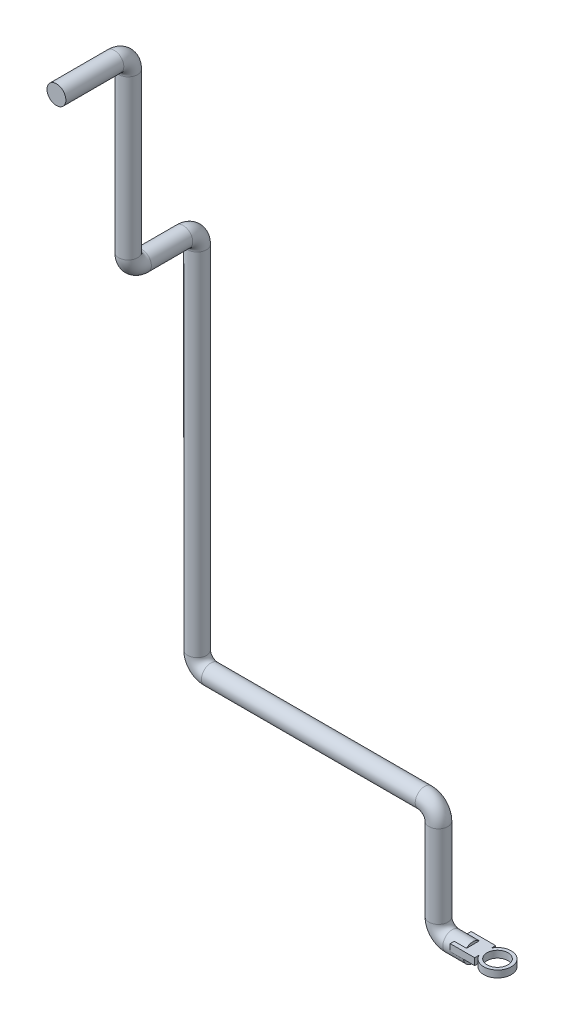
ISO-10303-21;
HEADER;
FILE_DESCRIPTION(('STEP AP214'),'2;1');
FILE_NAME('part.step','',(''),(''),'','','');
FILE_SCHEMA(('AUTOMOTIVE_DESIGN { 1 0 10303 214 1 1 1 1 }'));
ENDSEC;
DATA;
#1=APPLICATION_CONTEXT('core data for automotive mechanical design processes');
#2=APPLICATION_PROTOCOL_DEFINITION('international standard','automotive_design',2000,#1);
#3=PRODUCT_CONTEXT('',#1,'mechanical');
#4=PRODUCT('Part','Part','',(#3));
#5=PRODUCT_RELATED_PRODUCT_CATEGORY('part','',(#4));
#6=PRODUCT_DEFINITION_FORMATION('','',#4);
#7=PRODUCT_DEFINITION_CONTEXT('part definition',#1,'design');
#8=PRODUCT_DEFINITION('design','',#6,#7);
#9=PRODUCT_DEFINITION_SHAPE('','',#8);
#10=(LENGTH_UNIT() NAMED_UNIT(*) SI_UNIT(.MILLI.,.METRE.));
#11=(NAMED_UNIT(*) PLANE_ANGLE_UNIT() SI_UNIT($,.RADIAN.));
#12=(NAMED_UNIT(*) SI_UNIT($,.STERADIAN.) SOLID_ANGLE_UNIT());
#13=UNCERTAINTY_MEASURE_WITH_UNIT(LENGTH_MEASURE(1.E-05),#10,'distance_accuracy_value','');
#14=(GEOMETRIC_REPRESENTATION_CONTEXT(3) GLOBAL_UNCERTAINTY_ASSIGNED_CONTEXT((#13)) GLOBAL_UNIT_ASSIGNED_CONTEXT((#10,
#11,#12)) REPRESENTATION_CONTEXT('',''));
#15=CARTESIAN_POINT('',(0.,0.,0.));
#16=DIRECTION('',(0.,0.,1.));
#17=DIRECTION('',(1.,0.,0.));
#18=AXIS2_PLACEMENT_3D('',#15,#16,#17);
#19=CARTESIAN_POINT('',(0.,0.,0.));
#20=DIRECTION('',(1.,0.,0.));
#21=DIRECTION('',(0.,0.,-1.));
#22=AXIS2_PLACEMENT_3D('',#19,#20,#21);
#23=PLANE('',#22);
#24=CARTESIAN_POINT('',(0.,0.,0.));
#25=DIRECTION('',(1.,0.,0.));
#26=DIRECTION('',(0.,0.,-1.));
#27=AXIS2_PLACEMENT_3D('',#24,#25,#26);
#28=CIRCLE('',#27,13.7);
#29=CARTESIAN_POINT('',(0.,0.,13.7));
#30=VERTEX_POINT('',#29);
#31=CARTESIAN_POINT('',(0.,0.,-13.7));
#32=VERTEX_POINT('',#31);
#33=EDGE_CURVE('E185',#30,#32,#28,.T.);
#34=ORIENTED_EDGE('',*,*,#33,.T.);
#35=DIRECTION('',(0.,0.,1.));
#36=VECTOR('',#35,1.);
#37=CARTESIAN_POINT('',(0.,0.,0.));
#38=LINE('',#37,#36);
#39=EDGE_CURVE('E122',#32,#30,#38,.T.);
#40=ORIENTED_EDGE('',*,*,#39,.T.);
#41=EDGE_LOOP('',(#34,#40));
#42=FACE_BOUND('',#41,.T.);
#43=ADVANCED_FACE('F36',(#42),#23,.T.);
#44=DIRECTION('',(0.,0.,1.));
#45=VECTOR('',#44,1.);
#46=CARTESIAN_POINT('',(0.,10.,0.));
#47=LINE('',#46,#45);
#48=CARTESIAN_POINT('',(0.,10.,-9.36429388688757));
#49=VERTEX_POINT('',#48);
#50=CARTESIAN_POINT('',(0.,10.,9.36429388688757));
#51=VERTEX_POINT('',#50);
#52=EDGE_CURVE('E182',#49,#51,#47,.T.);
#53=ORIENTED_EDGE('',*,*,#52,.F.);
#54=EDGE_CURVE('E188',#49,#51,#28,.T.);
#55=ORIENTED_EDGE('',*,*,#54,.T.);
#56=EDGE_LOOP('',(#53,#55));
#57=FACE_BOUND('',#56,.T.);
#58=ADVANCED_FACE('F38',(#57),#23,.T.);
#59=CARTESIAN_POINT('',(-400.,979.4,204.));
#60=DIRECTION('',(0.,0.,-1.));
#61=DIRECTION('',(0.,1.,0.));
#62=AXIS2_PLACEMENT_3D('',#59,#60,#61);
#63=PLANE('',#62);
#64=CARTESIAN_POINT('',(-400.,979.4,204.));
#65=DIRECTION('',(0.,0.,-1.));
#66=DIRECTION('',(0.,1.,0.));
#67=AXIS2_PLACEMENT_3D('',#64,#65,#66);
#68=CIRCLE('',#67,13.7);
#69=CARTESIAN_POINT('',(-400.,993.1,204.));
#70=VERTEX_POINT('',#69);
#71=EDGE_CURVE('E225',#70,#70,#68,.T.);
#72=ORIENTED_EDGE('',*,*,#71,.F.);
#73=EDGE_LOOP('',(#72));
#74=FACE_BOUND('',#73,.T.);
#75=ADVANCED_FACE('F264',(#74),#63,.F.);
#76=CARTESIAN_POINT('',(0.,0.,0.));
#77=DIRECTION('',(-1.,0.,0.));
#78=DIRECTION('',(0.,0.,1.));
#79=AXIS2_PLACEMENT_3D('',#76,#77,#78);
#80=CYLINDRICAL_SURFACE('',#79,13.7);
#81=CARTESIAN_POINT('',(-30.,0.,0.));
#82=DIRECTION('',(1.,0.,0.));
#83=DIRECTION('',(0.,0.,-1.));
#84=AXIS2_PLACEMENT_3D('',#81,#82,#83);
#85=CIRCLE('',#84,13.7);
#86=CARTESIAN_POINT('',(-30.,-13.7,0.));
#87=VERTEX_POINT('',#86);
#88=EDGE_CURVE('E189',#87,#87,#85,.T.);
#89=ORIENTED_EDGE('',*,*,#88,.T.);
#90=EDGE_LOOP('',(#89));
#91=FACE_BOUND('',#90,.T.);
#92=ORIENTED_EDGE('',*,*,#54,.F.);
#93=DIRECTION('',(-1.,0.,0.));
#94=VECTOR('',#93,1.);
#95=CARTESIAN_POINT('',(0.,10.,-9.36429388688757));
#96=LINE('',#95,#94);
#97=CARTESIAN_POINT('',(-17.743007843469,10.,-9.36429388688757));
#98=VERTEX_POINT('',#97);
#99=EDGE_CURVE('E11',#49,#98,#96,.T.);
#100=ORIENTED_EDGE('',*,*,#99,.T.);
#101=CARTESIAN_POINT('',(-17.743007843469,0.,0.));
#102=DIRECTION('',(1.,0.,0.));
#103=DIRECTION('',(0.,0.,-1.));
#104=AXIS2_PLACEMENT_3D('',#101,#102,#103);
#105=CIRCLE('',#104,13.7);
#106=CARTESIAN_POINT('',(-17.743007843469,0.,-13.7));
#107=VERTEX_POINT('',#106);
#108=EDGE_CURVE('E44',#107,#98,#105,.T.);
#109=ORIENTED_EDGE('',*,*,#108,.F.);
#110=DIRECTION('',(-1.,0.,0.));
#111=VECTOR('',#110,1.);
#112=CARTESIAN_POINT('',(0.,0.,-13.7));
#113=LINE('',#112,#111);
#114=EDGE_CURVE('E234',#32,#107,#113,.T.);
#115=ORIENTED_EDGE('',*,*,#114,.F.);
#116=ORIENTED_EDGE('',*,*,#33,.F.);
#117=DIRECTION('',(-1.,0.,0.));
#118=VECTOR('',#117,1.);
#119=CARTESIAN_POINT('',(0.,0.,13.7));
#120=LINE('',#119,#118);
#121=CARTESIAN_POINT('',(-17.743007843469,0.,13.7));
#122=VERTEX_POINT('',#121);
#123=EDGE_CURVE('E227',#122,#30,#120,.F.);
#124=ORIENTED_EDGE('',*,*,#123,.F.);
#125=CARTESIAN_POINT('',(-17.743007843469,10.,9.36429388688757));
#126=VERTEX_POINT('',#125);
#127=EDGE_CURVE('E230',#126,#122,#105,.T.);
#128=ORIENTED_EDGE('',*,*,#127,.F.);
#129=DIRECTION('',(-1.,0.,0.));
#130=VECTOR('',#129,1.);
#131=CARTESIAN_POINT('',(0.,10.,9.36429388688757));
#132=LINE('',#131,#130);
#133=EDGE_CURVE('E233',#126,#51,#132,.F.);
#134=ORIENTED_EDGE('',*,*,#133,.T.);
#135=EDGE_LOOP('',(#92,#100,#109,#115,#116,#124,#128,#134));
#136=FACE_BOUND('',#135,.T.);
#137=ADVANCED_FACE('F281',(#91,#136),#80,.T.);
#138=CARTESIAN_POINT('',(-30.,20.,0.));
#139=DIRECTION('',(0.,0.,-1.));
#140=DIRECTION('',(-1.,0.,0.));
#141=AXIS2_PLACEMENT_3D('',#138,#139,#140);
#142=TOROIDAL_SURFACE('',#141,20.,13.7);
#143=CARTESIAN_POINT('',(-50.,20.,0.));
#144=DIRECTION('',(0.,-1.,0.));
#145=DIRECTION('',(0.,0.,-1.));
#146=AXIS2_PLACEMENT_3D('',#143,#144,#145);
#147=CIRCLE('',#146,13.7);
#148=CARTESIAN_POINT('',(-63.7,20.,0.));
#149=VERTEX_POINT('',#148);
#150=EDGE_CURVE('E192',#149,#149,#147,.T.);
#151=CARTESIAN_POINT('',(-30.,20.,0.));
#152=DIRECTION('',(0.,0.,-1.));
#153=DIRECTION('',(-1.,0.,0.));
#154=AXIS2_PLACEMENT_3D('',#151,#152,#153);
#155=CIRCLE('',#154,33.7);
#156=EDGE_CURVE('',#87,#149,#155,.T.);
#157=ORIENTED_EDGE('',*,*,#88,.F.);
#158=ORIENTED_EDGE('',*,*,#150,.T.);
#159=ORIENTED_EDGE('',*,*,#156,.T.);
#160=ORIENTED_EDGE('',*,*,#156,.F.);
#161=EDGE_LOOP('',(#157,#159,#158,#160));
#162=FACE_BOUND('',#161,.T.);
#163=ADVANCED_FACE('F286',(#162),#142,.T.);
#164=CARTESIAN_POINT('',(-50.,20.,0.));
#165=DIRECTION('',(0.,1.,0.));
#166=DIRECTION('',(0.,0.,1.));
#167=AXIS2_PLACEMENT_3D('',#164,#165,#166);
#168=CYLINDRICAL_SURFACE('',#167,13.7);
#169=CARTESIAN_POINT('',(-50.,140.,0.));
#170=DIRECTION('',(0.,-1.,0.));
#171=DIRECTION('',(0.,0.,-1.));
#172=AXIS2_PLACEMENT_3D('',#169,#170,#171);
#173=CIRCLE('',#172,13.7);
#174=CARTESIAN_POINT('',(-36.3,140.,0.));
#175=VERTEX_POINT('',#174);
#176=EDGE_CURVE('E195',#175,#175,#173,.T.);
#177=ORIENTED_EDGE('',*,*,#176,.T.);
#178=EDGE_LOOP('',(#177));
#179=FACE_BOUND('',#178,.T.);
#180=ORIENTED_EDGE('',*,*,#150,.F.);
#181=EDGE_LOOP('',(#180));
#182=FACE_BOUND('',#181,.T.);
#183=ADVANCED_FACE('F293',(#179,#182),#168,.T.);
#184=CARTESIAN_POINT('',(-70.,140.,0.));
#185=DIRECTION('',(0.,0.,1.));
#186=DIRECTION('',(1.,0.,0.));
#187=AXIS2_PLACEMENT_3D('',#184,#185,#186);
#188=TOROIDAL_SURFACE('',#187,20.,13.7);
#189=CARTESIAN_POINT('',(-70.,160.,0.));
#190=DIRECTION('',(1.,0.,0.));
#191=DIRECTION('',(0.,0.,-1.));
#192=AXIS2_PLACEMENT_3D('',#189,#190,#191);
#193=CIRCLE('',#192,13.7);
#194=CARTESIAN_POINT('',(-70.,173.7,0.));
#195=VERTEX_POINT('',#194);
#196=EDGE_CURVE('E198',#195,#195,#193,.T.);
#197=CARTESIAN_POINT('',(-70.,140.,0.));
#198=DIRECTION('',(0.,0.,1.));
#199=DIRECTION('',(1.,0.,0.));
#200=AXIS2_PLACEMENT_3D('',#197,#198,#199);
#201=CIRCLE('',#200,33.7);
#202=EDGE_CURVE('',#175,#195,#201,.T.);
#203=ORIENTED_EDGE('',*,*,#176,.F.);
#204=ORIENTED_EDGE('',*,*,#196,.T.);
#205=ORIENTED_EDGE('',*,*,#202,.T.);
#206=ORIENTED_EDGE('',*,*,#202,.F.);
#207=EDGE_LOOP('',(#203,#205,#204,#206));
#208=FACE_BOUND('',#207,.T.);
#209=ADVANCED_FACE('F300',(#208),#188,.T.);
#210=CARTESIAN_POINT('',(-70.,160.,0.));
#211=DIRECTION('',(-1.,0.,0.));
#212=DIRECTION('',(0.,0.,1.));
#213=AXIS2_PLACEMENT_3D('',#210,#211,#212);
#214=CYLINDRICAL_SURFACE('',#213,13.7);
#215=CARTESIAN_POINT('',(-380.,160.,0.));
#216=DIRECTION('',(1.,0.,0.));
#217=DIRECTION('',(0.,0.,-1.));
#218=AXIS2_PLACEMENT_3D('',#215,#216,#217);
#219=CIRCLE('',#218,13.7);
#220=CARTESIAN_POINT('',(-380.,146.3,0.));
#221=VERTEX_POINT('',#220);
#222=EDGE_CURVE('E201',#221,#221,#219,.T.);
#223=ORIENTED_EDGE('',*,*,#222,.T.);
#224=EDGE_LOOP('',(#223));
#225=FACE_BOUND('',#224,.T.);
#226=ORIENTED_EDGE('',*,*,#196,.F.);
#227=EDGE_LOOP('',(#226));
#228=FACE_BOUND('',#227,.T.);
#229=ADVANCED_FACE('F304',(#225,#228),#214,.T.);
#230=CARTESIAN_POINT('',(-380.,180.,0.));
#231=DIRECTION('',(0.,0.,-1.));
#232=DIRECTION('',(-1.,0.,0.));
#233=AXIS2_PLACEMENT_3D('',#230,#231,#232);
#234=TOROIDAL_SURFACE('',#233,20.,13.7);
#235=CARTESIAN_POINT('',(-400.,180.,0.));
#236=DIRECTION('',(0.,-1.,0.));
#237=DIRECTION('',(0.,0.,-1.));
#238=AXIS2_PLACEMENT_3D('',#235,#236,#237);
#239=CIRCLE('',#238,13.7);
#240=CARTESIAN_POINT('',(-413.7,180.,0.));
#241=VERTEX_POINT('',#240);
#242=EDGE_CURVE('E204',#241,#241,#239,.T.);
#243=CARTESIAN_POINT('',(-380.,180.,0.));
#244=DIRECTION('',(0.,0.,-1.));
#245=DIRECTION('',(-1.,0.,0.));
#246=AXIS2_PLACEMENT_3D('',#243,#244,#245);
#247=CIRCLE('',#246,33.7);
#248=EDGE_CURVE('',#221,#241,#247,.T.);
#249=ORIENTED_EDGE('',*,*,#222,.F.);
#250=ORIENTED_EDGE('',*,*,#242,.T.);
#251=ORIENTED_EDGE('',*,*,#248,.T.);
#252=ORIENTED_EDGE('',*,*,#248,.F.);
#253=EDGE_LOOP('',(#249,#251,#250,#252));
#254=FACE_BOUND('',#253,.T.);
#255=ADVANCED_FACE('F308',(#254),#234,.T.);
#256=CARTESIAN_POINT('',(-400.,180.,0.));
#257=DIRECTION('',(0.,1.,0.));
#258=DIRECTION('',(0.,0.,1.));
#259=AXIS2_PLACEMENT_3D('',#256,#257,#258);
#260=CYLINDRICAL_SURFACE('',#259,13.7);
#261=CARTESIAN_POINT('',(-400.,689.4,0.));
#262=DIRECTION('',(0.,-1.,0.));
#263=DIRECTION('',(0.,0.,-1.));
#264=AXIS2_PLACEMENT_3D('',#261,#262,#263);
#265=CIRCLE('',#264,13.7);
#266=CARTESIAN_POINT('',(-400.,689.4,-13.7));
#267=VERTEX_POINT('',#266);
#268=EDGE_CURVE('E207',#267,#267,#265,.T.);
#269=ORIENTED_EDGE('',*,*,#268,.T.);
#270=EDGE_LOOP('',(#269));
#271=FACE_BOUND('',#270,.T.);
#272=ORIENTED_EDGE('',*,*,#242,.F.);
#273=EDGE_LOOP('',(#272));
#274=FACE_BOUND('',#273,.T.);
#275=ADVANCED_FACE('F312',(#271,#274),#260,.T.);
#276=CARTESIAN_POINT('',(-400.,689.4,20.));
#277=DIRECTION('',(1.,0.,0.));
#278=DIRECTION('',(0.,0.,-1.));
#279=AXIS2_PLACEMENT_3D('',#276,#277,#278);
#280=TOROIDAL_SURFACE('',#279,20.,13.7);
#281=CARTESIAN_POINT('',(-400.,709.4,20.));
#282=DIRECTION('',(0.,0.,-1.));
#283=DIRECTION('',(0.,1.,0.));
#284=AXIS2_PLACEMENT_3D('',#281,#282,#283);
#285=CIRCLE('',#284,13.7);
#286=CARTESIAN_POINT('',(-400.,723.1,20.));
#287=VERTEX_POINT('',#286);
#288=EDGE_CURVE('E210',#287,#287,#285,.T.);
#289=CARTESIAN_POINT('',(-400.,689.4,20.));
#290=DIRECTION('',(1.,0.,0.));
#291=DIRECTION('',(0.,0.,-1.));
#292=AXIS2_PLACEMENT_3D('',#289,#290,#291);
#293=CIRCLE('',#292,33.7);
#294=EDGE_CURVE('',#267,#287,#293,.T.);
#295=ORIENTED_EDGE('',*,*,#268,.F.);
#296=ORIENTED_EDGE('',*,*,#288,.T.);
#297=ORIENTED_EDGE('',*,*,#294,.T.);
#298=ORIENTED_EDGE('',*,*,#294,.F.);
#299=EDGE_LOOP('',(#295,#297,#296,#298));
#300=FACE_BOUND('',#299,.T.);
#301=ADVANCED_FACE('F316',(#300),#280,.T.);
#302=CARTESIAN_POINT('',(-400.,709.4,20.));
#303=DIRECTION('',(0.,0.,1.));
#304=DIRECTION('',(1.,0.,0.));
#305=AXIS2_PLACEMENT_3D('',#302,#303,#304);
#306=CYLINDRICAL_SURFACE('',#305,13.7);
#307=CARTESIAN_POINT('',(-400.,709.4,80.));
#308=DIRECTION('',(0.,0.,-1.));
#309=DIRECTION('',(0.,1.,0.));
#310=AXIS2_PLACEMENT_3D('',#307,#308,#309);
#311=CIRCLE('',#310,13.7);
#312=CARTESIAN_POINT('',(-400.,695.7,80.));
#313=VERTEX_POINT('',#312);
#314=EDGE_CURVE('E213',#313,#313,#311,.T.);
#315=ORIENTED_EDGE('',*,*,#314,.T.);
#316=EDGE_LOOP('',(#315));
#317=FACE_BOUND('',#316,.T.);
#318=ORIENTED_EDGE('',*,*,#288,.F.);
#319=EDGE_LOOP('',(#318));
#320=FACE_BOUND('',#319,.T.);
#321=ADVANCED_FACE('F320',(#317,#320),#306,.T.);
#322=CARTESIAN_POINT('',(-400.,729.4,80.));
#323=DIRECTION('',(-1.,0.,0.));
#324=DIRECTION('',(0.,0.,1.));
#325=AXIS2_PLACEMENT_3D('',#322,#323,#324);
#326=TOROIDAL_SURFACE('',#325,20.,13.7);
#327=CARTESIAN_POINT('',(-400.,729.4,100.));
#328=DIRECTION('',(0.,-1.,0.));
#329=DIRECTION('',(0.,0.,-1.));
#330=AXIS2_PLACEMENT_3D('',#327,#328,#329);
#331=CIRCLE('',#330,13.7);
#332=CARTESIAN_POINT('',(-400.,729.4,113.7));
#333=VERTEX_POINT('',#332);
#334=EDGE_CURVE('E216',#333,#333,#331,.T.);
#335=CARTESIAN_POINT('',(-400.,729.4,80.));
#336=DIRECTION('',(-1.,0.,0.));
#337=DIRECTION('',(0.,0.,1.));
#338=AXIS2_PLACEMENT_3D('',#335,#336,#337);
#339=CIRCLE('',#338,33.7);
#340=EDGE_CURVE('',#313,#333,#339,.T.);
#341=ORIENTED_EDGE('',*,*,#314,.F.);
#342=ORIENTED_EDGE('',*,*,#334,.T.);
#343=ORIENTED_EDGE('',*,*,#340,.T.);
#344=ORIENTED_EDGE('',*,*,#340,.F.);
#345=EDGE_LOOP('',(#341,#343,#342,#344));
#346=FACE_BOUND('',#345,.T.);
#347=ADVANCED_FACE('F324',(#346),#326,.T.);
#348=CARTESIAN_POINT('',(-400.,729.4,100.));
#349=DIRECTION('',(0.,1.,0.));
#350=DIRECTION('',(-1.,0.,0.));
#351=AXIS2_PLACEMENT_3D('',#348,#349,#350);
#352=CYLINDRICAL_SURFACE('',#351,13.7);
#353=CARTESIAN_POINT('',(-400.,959.4,100.));
#354=DIRECTION('',(0.,-1.,0.));
#355=DIRECTION('',(0.,0.,-1.));
#356=AXIS2_PLACEMENT_3D('',#353,#354,#355);
#357=CIRCLE('',#356,13.7);
#358=CARTESIAN_POINT('',(-400.,959.4,86.3));
#359=VERTEX_POINT('',#358);
#360=EDGE_CURVE('E219',#359,#359,#357,.T.);
#361=ORIENTED_EDGE('',*,*,#360,.T.);
#362=EDGE_LOOP('',(#361));
#363=FACE_BOUND('',#362,.T.);
#364=ORIENTED_EDGE('',*,*,#334,.F.);
#365=EDGE_LOOP('',(#364));
#366=FACE_BOUND('',#365,.T.);
#367=ADVANCED_FACE('F275',(#363,#366),#352,.T.);
#368=CARTESIAN_POINT('',(-400.,959.4,120.));
#369=DIRECTION('',(1.,0.,0.));
#370=DIRECTION('',(0.,0.,-1.));
#371=AXIS2_PLACEMENT_3D('',#368,#369,#370);
#372=TOROIDAL_SURFACE('',#371,20.,13.7);
#373=CARTESIAN_POINT('',(-400.,979.4,120.));
#374=DIRECTION('',(0.,0.,-1.));
#375=DIRECTION('',(0.,1.,0.));
#376=AXIS2_PLACEMENT_3D('',#373,#374,#375);
#377=CIRCLE('',#376,13.7);
#378=CARTESIAN_POINT('',(-400.,993.1,120.));
#379=VERTEX_POINT('',#378);
#380=EDGE_CURVE('E222',#379,#379,#377,.T.);
#381=CARTESIAN_POINT('',(-400.,959.4,120.));
#382=DIRECTION('',(1.,0.,0.));
#383=DIRECTION('',(0.,0.,-1.));
#384=AXIS2_PLACEMENT_3D('',#381,#382,#383);
#385=CIRCLE('',#384,33.7);
#386=EDGE_CURVE('',#359,#379,#385,.T.);
#387=ORIENTED_EDGE('',*,*,#360,.F.);
#388=ORIENTED_EDGE('',*,*,#380,.T.);
#389=ORIENTED_EDGE('',*,*,#386,.T.);
#390=ORIENTED_EDGE('',*,*,#386,.F.);
#391=EDGE_LOOP('',(#387,#389,#388,#390));
#392=FACE_BOUND('',#391,.T.);
#393=ADVANCED_FACE('F267',(#392),#372,.T.);
#394=CARTESIAN_POINT('',(-400.,979.4,120.));
#395=DIRECTION('',(0.,0.,1.));
#396=DIRECTION('',(1.,0.,0.));
#397=AXIS2_PLACEMENT_3D('',#394,#395,#396);
#398=CYLINDRICAL_SURFACE('',#397,13.7);
#399=ORIENTED_EDGE('',*,*,#71,.T.);
#400=EDGE_LOOP('',(#399));
#401=FACE_BOUND('',#400,.T.);
#402=ORIENTED_EDGE('',*,*,#380,.F.);
#403=EDGE_LOOP('',(#402));
#404=FACE_BOUND('',#403,.T.);
#405=ADVANCED_FACE('F260',(#401,#404),#398,.T.);
#406=CARTESIAN_POINT('',(-17.743007843469,10.,0.));
#407=DIRECTION('',(1.,0.,0.));
#408=DIRECTION('',(0.,0.,-1.));
#409=AXIS2_PLACEMENT_3D('',#406,#407,#408);
#410=PLANE('',#409);
#411=DIRECTION('',(0.,0.,1.));
#412=VECTOR('',#411,1.);
#413=CARTESIAN_POINT('',(-17.743007843469,0.,0.));
#414=LINE('',#413,#412);
#415=CARTESIAN_POINT('',(-17.743007843469,0.,-15.2155348340664));
#416=VERTEX_POINT('',#415);
#417=EDGE_CURVE('E166',#416,#107,#414,.T.);
#418=ORIENTED_EDGE('',*,*,#417,.T.);
#419=ORIENTED_EDGE('',*,*,#108,.T.);
#420=DIRECTION('',(0.,0.,1.));
#421=VECTOR('',#420,1.);
#422=CARTESIAN_POINT('',(-17.743007843469,10.,0.));
#423=LINE('',#422,#421);
#424=CARTESIAN_POINT('',(-17.743007843469,10.,-15.2155348340664));
#425=VERTEX_POINT('',#424);
#426=EDGE_CURVE('E148',#425,#98,#423,.T.);
#427=ORIENTED_EDGE('',*,*,#426,.F.);
#428=DIRECTION('',(0.,-1.,0.));
#429=VECTOR('',#428,1.);
#430=CARTESIAN_POINT('',(-17.743007843469,10.,-15.2155348340664));
#431=LINE('',#430,#429);
#432=EDGE_CURVE('E175',#425,#416,#431,.T.);
#433=ORIENTED_EDGE('',*,*,#432,.T.);
#434=EDGE_LOOP('',(#418,#419,#427,#433));
#435=FACE_BOUND('',#434,.T.);
#436=ADVANCED_FACE('F240',(#435),#410,.F.);
#437=CARTESIAN_POINT('',(0.,10.,0.));
#438=DIRECTION('',(0.,1.,0.));
#439=DIRECTION('',(0.,0.,1.));
#440=AXIS2_PLACEMENT_3D('',#437,#438,#439);
#441=PLANE('',#440);
#442=CARTESIAN_POINT('',(35.6701668970035,10.,0.));
#443=DIRECTION('',(0.,1.,0.));
#444=DIRECTION('',(0.,0.,1.));
#445=AXIS2_PLACEMENT_3D('',#442,#443,#444);
#446=CIRCLE('',#445,15.2155348340664);
#447=CARTESIAN_POINT('',(35.6701668970035,10.,15.2155348340664));
#448=VERTEX_POINT('',#447);
#449=EDGE_CURVE('E152',#448,#448,#446,.T.);
#450=ORIENTED_EDGE('',*,*,#449,.F.);
#451=EDGE_LOOP('',(#450));
#452=FACE_BOUND('',#451,.T.);
#453=ORIENTED_EDGE('',*,*,#99,.F.);
#454=ORIENTED_EDGE('',*,*,#52,.T.);
#455=ORIENTED_EDGE('',*,*,#133,.F.);
#456=CARTESIAN_POINT('',(-17.743007843469,10.,15.2155348340664));
#457=VERTEX_POINT('',#456);
#458=EDGE_CURVE('E147',#126,#457,#423,.T.);
#459=ORIENTED_EDGE('',*,*,#458,.T.);
#460=DIRECTION('',(1.,0.,0.));
#461=VECTOR('',#460,1.);
#462=CARTESIAN_POINT('',(0.,10.,15.2155348340664));
#463=LINE('',#462,#461);
#464=CARTESIAN_POINT('',(17.743007843469,10.,15.2155348340664));
#465=VERTEX_POINT('',#464);
#466=EDGE_CURVE('E135',#457,#465,#463,.T.);
#467=ORIENTED_EDGE('',*,*,#466,.T.);
#468=DIRECTION('',(0.,0.,1.));
#469=VECTOR('',#468,1.);
#470=CARTESIAN_POINT('',(17.743007843469,10.,0.));
#471=LINE('',#470,#469);
#472=CARTESIAN_POINT('',(17.743007843469,10.,8.85614338755977));
#473=VERTEX_POINT('',#472);
#474=EDGE_CURVE('E116',#473,#465,#471,.T.);
#475=ORIENTED_EDGE('',*,*,#474,.F.);
#476=CARTESIAN_POINT('',(35.6701668970035,10.,0.));
#477=DIRECTION('',(0.,1.,0.));
#478=DIRECTION('',(0.,0.,1.));
#479=AXIS2_PLACEMENT_3D('',#476,#477,#478);
#480=CIRCLE('',#479,19.9953571468914);
#481=CARTESIAN_POINT('',(17.743007843469,10.,-8.85614338755977));
#482=VERTEX_POINT('',#481);
#483=EDGE_CURVE('E126',#473,#482,#480,.T.);
#484=ORIENTED_EDGE('',*,*,#483,.T.);
#485=DIRECTION('',(0.,0.,1.));
#486=VECTOR('',#485,1.);
#487=CARTESIAN_POINT('',(17.743007843469,10.,0.));
#488=LINE('',#487,#486);
#489=CARTESIAN_POINT('',(17.743007843469,10.,-15.2155348340664));
#490=VERTEX_POINT('',#489);
#491=EDGE_CURVE('E131',#490,#482,#488,.T.);
#492=ORIENTED_EDGE('',*,*,#491,.F.);
#493=DIRECTION('',(1.,0.,0.));
#494=VECTOR('',#493,1.);
#495=CARTESIAN_POINT('',(0.,10.,-15.2155348340664));
#496=LINE('',#495,#494);
#497=EDGE_CURVE('E144',#425,#490,#496,.T.);
#498=ORIENTED_EDGE('',*,*,#497,.F.);
#499=ORIENTED_EDGE('',*,*,#426,.T.);
#500=EDGE_LOOP('',(#453,#454,#455,#459,#467,#475,#484,#492,#498,#499));
#501=FACE_BOUND('',#500,.T.);
#502=ADVANCED_FACE('F133',(#452,#501),#441,.T.);
#503=CARTESIAN_POINT('',(0.,0.,0.));
#504=DIRECTION('',(0.,1.,0.));
#505=DIRECTION('',(0.,0.,1.));
#506=AXIS2_PLACEMENT_3D('',#503,#504,#505);
#507=PLANE('',#506);
#508=CARTESIAN_POINT('',(35.6701668970035,0.,0.));
#509=DIRECTION('',(0.,1.,0.));
#510=DIRECTION('',(0.,0.,1.));
#511=AXIS2_PLACEMENT_3D('',#508,#509,#510);
#512=CIRCLE('',#511,15.2155348340664);
#513=CARTESIAN_POINT('',(35.6701668970035,0.,15.2155348340664));
#514=VERTEX_POINT('',#513);
#515=EDGE_CURVE('E137',#514,#514,#512,.T.);
#516=ORIENTED_EDGE('',*,*,#515,.T.);
#517=EDGE_LOOP('',(#516));
#518=FACE_BOUND('',#517,.T.);
#519=ORIENTED_EDGE('',*,*,#39,.F.);
#520=ORIENTED_EDGE('',*,*,#114,.T.);
#521=ORIENTED_EDGE('',*,*,#417,.F.);
#522=DIRECTION('',(1.,0.,0.));
#523=VECTOR('',#522,1.);
#524=CARTESIAN_POINT('',(0.,0.,-15.2155348340664));
#525=LINE('',#524,#523);
#526=CARTESIAN_POINT('',(17.743007843469,0.,-15.2155348340664));
#527=VERTEX_POINT('',#526);
#528=EDGE_CURVE('E162',#416,#527,#525,.T.);
#529=ORIENTED_EDGE('',*,*,#528,.T.);
#530=DIRECTION('',(0.,0.,1.));
#531=VECTOR('',#530,1.);
#532=CARTESIAN_POINT('',(17.743007843469,0.,0.));
#533=LINE('',#532,#531);
#534=CARTESIAN_POINT('',(17.743007843469,0.,-8.85614338755977));
#535=VERTEX_POINT('',#534);
#536=EDGE_CURVE('E159',#527,#535,#533,.T.);
#537=ORIENTED_EDGE('',*,*,#536,.T.);
#538=CARTESIAN_POINT('',(35.6701668970035,0.,0.));
#539=DIRECTION('',(0.,1.,0.));
#540=DIRECTION('',(0.,0.,1.));
#541=AXIS2_PLACEMENT_3D('',#538,#539,#540);
#542=CIRCLE('',#541,19.9953571468914);
#543=CARTESIAN_POINT('',(17.743007843469,0.,8.85614338755977));
#544=VERTEX_POINT('',#543);
#545=EDGE_CURVE('E157',#544,#535,#542,.T.);
#546=ORIENTED_EDGE('',*,*,#545,.F.);
#547=DIRECTION('',(0.,0.,1.));
#548=VECTOR('',#547,1.);
#549=CARTESIAN_POINT('',(17.743007843469,0.,0.));
#550=LINE('',#549,#548);
#551=CARTESIAN_POINT('',(17.743007843469,0.,15.2155348340664));
#552=VERTEX_POINT('',#551);
#553=EDGE_CURVE('E118',#544,#552,#550,.T.);
#554=ORIENTED_EDGE('',*,*,#553,.T.);
#555=DIRECTION('',(1.,0.,0.));
#556=VECTOR('',#555,1.);
#557=CARTESIAN_POINT('',(0.,0.,15.2155348340664));
#558=LINE('',#557,#556);
#559=CARTESIAN_POINT('',(-17.743007843469,0.,15.2155348340664));
#560=VERTEX_POINT('',#559);
#561=EDGE_CURVE('E140',#560,#552,#558,.T.);
#562=ORIENTED_EDGE('',*,*,#561,.F.);
#563=EDGE_CURVE('E165',#122,#560,#414,.T.);
#564=ORIENTED_EDGE('',*,*,#563,.F.);
#565=ORIENTED_EDGE('',*,*,#123,.T.);
#566=EDGE_LOOP('',(#519,#520,#521,#529,#537,#546,#554,#562,#564,#565));
#567=FACE_BOUND('',#566,.T.);
#568=ADVANCED_FACE('F246',(#518,#567),#507,.F.);
#569=CARTESIAN_POINT('',(17.743007843469,10.,0.));
#570=DIRECTION('',(1.,0.,0.));
#571=DIRECTION('',(0.,0.,-1.));
#572=AXIS2_PLACEMENT_3D('',#569,#570,#571);
#573=PLANE('',#572);
#574=ORIENTED_EDGE('',*,*,#553,.F.);
#575=DIRECTION('',(0.,-1.,0.));
#576=VECTOR('',#575,1.);
#577=CARTESIAN_POINT('',(17.743007843469,10.,8.85614338755977));
#578=LINE('',#577,#576);
#579=EDGE_CURVE('E112',#473,#544,#578,.T.);
#580=ORIENTED_EDGE('',*,*,#579,.F.);
#581=ORIENTED_EDGE('',*,*,#474,.T.);
#582=DIRECTION('',(0.,-1.,0.));
#583=VECTOR('',#582,1.);
#584=CARTESIAN_POINT('',(17.743007843469,10.,15.2155348340664));
#585=LINE('',#584,#583);
#586=EDGE_CURVE('E155',#465,#552,#585,.T.);
#587=ORIENTED_EDGE('',*,*,#586,.T.);
#588=EDGE_LOOP('',(#574,#580,#581,#587));
#589=FACE_BOUND('',#588,.T.);
#590=ADVANCED_FACE('F114',(#589),#573,.T.);
#591=CARTESIAN_POINT('',(35.6701668970035,10.,0.));
#592=DIRECTION('',(0.,-1.,0.));
#593=DIRECTION('',(0.,0.,-1.));
#594=AXIS2_PLACEMENT_3D('',#591,#592,#593);
#595=CYLINDRICAL_SURFACE('',#594,19.9953571468914);
#596=ORIENTED_EDGE('',*,*,#545,.T.);
#597=DIRECTION('',(0.,-1.,0.));
#598=VECTOR('',#597,1.);
#599=CARTESIAN_POINT('',(17.743007843469,10.,-8.85614338755977));
#600=LINE('',#599,#598);
#601=EDGE_CURVE('E123',#482,#535,#600,.T.);
#602=ORIENTED_EDGE('',*,*,#601,.F.);
#603=ORIENTED_EDGE('',*,*,#483,.F.);
#604=ORIENTED_EDGE('',*,*,#579,.T.);
#605=EDGE_LOOP('',(#596,#602,#603,#604));
#606=FACE_BOUND('',#605,.T.);
#607=ADVANCED_FACE('F127',(#606),#595,.T.);
#608=CARTESIAN_POINT('',(17.743007843469,10.,0.));
#609=DIRECTION('',(1.,0.,0.));
#610=DIRECTION('',(0.,0.,-1.));
#611=AXIS2_PLACEMENT_3D('',#608,#609,#610);
#612=PLANE('',#611);
#613=ORIENTED_EDGE('',*,*,#536,.F.);
#614=DIRECTION('',(0.,-1.,0.));
#615=VECTOR('',#614,1.);
#616=CARTESIAN_POINT('',(17.743007843469,10.,-15.2155348340664));
#617=LINE('',#616,#615);
#618=EDGE_CURVE('E177',#490,#527,#617,.T.);
#619=ORIENTED_EDGE('',*,*,#618,.F.);
#620=ORIENTED_EDGE('',*,*,#491,.T.);
#621=ORIENTED_EDGE('',*,*,#601,.T.);
#622=EDGE_LOOP('',(#613,#619,#620,#621));
#623=FACE_BOUND('',#622,.T.);
#624=ADVANCED_FACE('F248',(#623),#612,.T.);
#625=CARTESIAN_POINT('',(0.,10.,-15.2155348340664));
#626=DIRECTION('',(0.,0.,-1.));
#627=DIRECTION('',(-1.,0.,0.));
#628=AXIS2_PLACEMENT_3D('',#625,#626,#627);
#629=PLANE('',#628);
#630=ORIENTED_EDGE('',*,*,#528,.F.);
#631=ORIENTED_EDGE('',*,*,#432,.F.);
#632=ORIENTED_EDGE('',*,*,#497,.T.);
#633=ORIENTED_EDGE('',*,*,#618,.T.);
#634=EDGE_LOOP('',(#630,#631,#632,#633));
#635=FACE_BOUND('',#634,.T.);
#636=ADVANCED_FACE('F244',(#635),#629,.T.);
#637=ORIENTED_EDGE('',*,*,#458,.F.);
#638=ORIENTED_EDGE('',*,*,#127,.T.);
#639=ORIENTED_EDGE('',*,*,#563,.T.);
#640=DIRECTION('',(0.,-1.,0.));
#641=VECTOR('',#640,1.);
#642=CARTESIAN_POINT('',(-17.743007843469,10.,15.2155348340664));
#643=LINE('',#642,#641);
#644=EDGE_CURVE('E172',#457,#560,#643,.T.);
#645=ORIENTED_EDGE('',*,*,#644,.F.);
#646=EDGE_LOOP('',(#637,#638,#639,#645));
#647=FACE_BOUND('',#646,.T.);
#648=ADVANCED_FACE('F255',(#647),#410,.F.);
#649=CARTESIAN_POINT('',(0.,10.,15.2155348340664));
#650=DIRECTION('',(0.,0.,-1.));
#651=DIRECTION('',(-1.,0.,0.));
#652=AXIS2_PLACEMENT_3D('',#649,#650,#651);
#653=PLANE('',#652);
#654=ORIENTED_EDGE('',*,*,#561,.T.);
#655=ORIENTED_EDGE('',*,*,#586,.F.);
#656=ORIENTED_EDGE('',*,*,#466,.F.);
#657=ORIENTED_EDGE('',*,*,#644,.T.);
#658=EDGE_LOOP('',(#654,#655,#656,#657));
#659=FACE_BOUND('',#658,.T.);
#660=ADVANCED_FACE('F443',(#659),#653,.F.);
#661=CARTESIAN_POINT('',(35.6701668970035,10.,0.));
#662=DIRECTION('',(0.,-1.,0.));
#663=DIRECTION('',(0.,0.,-1.));
#664=AXIS2_PLACEMENT_3D('',#661,#662,#663);
#665=CYLINDRICAL_SURFACE('',#664,15.2155348340664);
#666=ORIENTED_EDGE('',*,*,#449,.T.);
#667=EDGE_LOOP('',(#666));
#668=FACE_BOUND('',#667,.T.);
#669=ORIENTED_EDGE('',*,*,#515,.F.);
#670=EDGE_LOOP('',(#669));
#671=FACE_BOUND('',#670,.T.);
#672=ADVANCED_FACE('F452',(#668,#671),#665,.F.);
#673=CLOSED_SHELL('',(#43,#58,#75,#137,#163,#183,#209,#229,#255,#275,#301,#321,#347,#367,#393,
#405,#436,#502,#568,#590,#607,#624,#636,#648,#660,#672));
#674=MANIFOLD_SOLID_BREP('B2',#673);
#675=ADVANCED_BREP_SHAPE_REPRESENTATION('',(#18,#674),#14);
#676=SHAPE_DEFINITION_REPRESENTATION(#9,#675);
ENDSEC;
END-ISO-10303-21;
